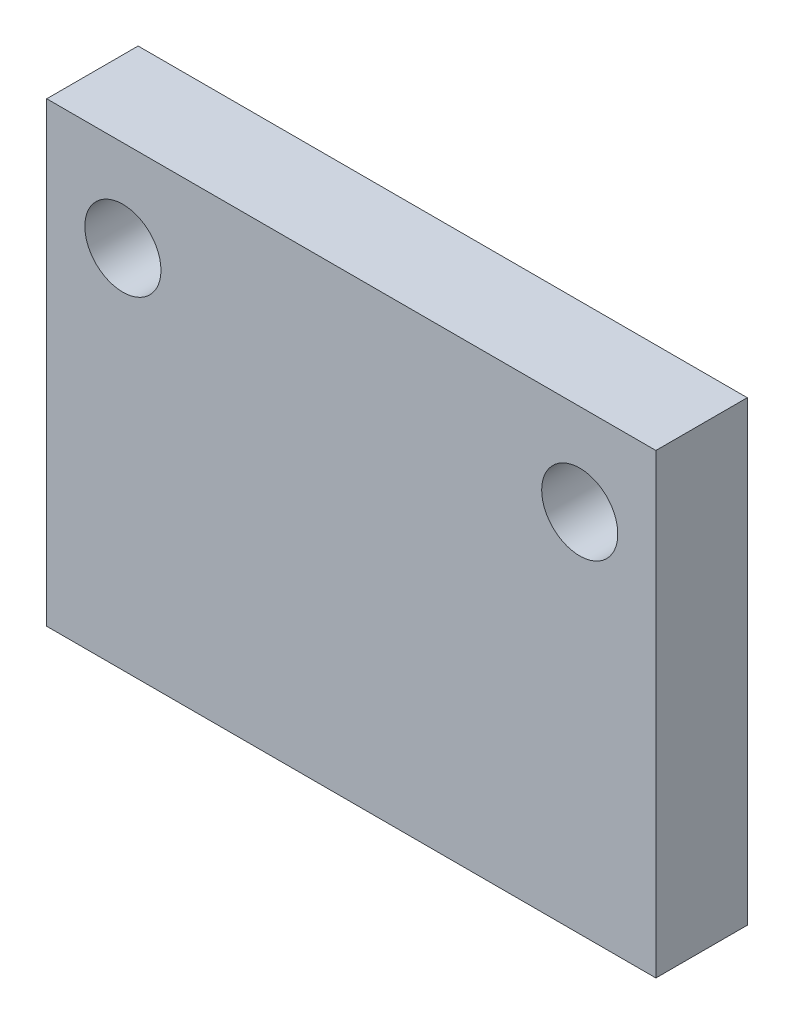
ISO-10303-21;
HEADER;
FILE_DESCRIPTION(('STEP AP214'),'2;1');
FILE_NAME('part.step','',(''),(''),'','','');
FILE_SCHEMA(('AUTOMOTIVE_DESIGN { 1 0 10303 214 1 1 1 1 }'));
ENDSEC;
DATA;
#1=APPLICATION_CONTEXT('core data for automotive mechanical design processes');
#2=APPLICATION_PROTOCOL_DEFINITION('international standard','automotive_design',2000,#1);
#3=PRODUCT_CONTEXT('',#1,'mechanical');
#4=PRODUCT('Part','Part','',(#3));
#5=PRODUCT_RELATED_PRODUCT_CATEGORY('part','',(#4));
#6=PRODUCT_DEFINITION_FORMATION('','',#4);
#7=PRODUCT_DEFINITION_CONTEXT('part definition',#1,'design');
#8=PRODUCT_DEFINITION('design','',#6,#7);
#9=PRODUCT_DEFINITION_SHAPE('','',#8);
#10=(LENGTH_UNIT() NAMED_UNIT(*) SI_UNIT(.MILLI.,.METRE.));
#11=(NAMED_UNIT(*) PLANE_ANGLE_UNIT() SI_UNIT($,.RADIAN.));
#12=(NAMED_UNIT(*) SI_UNIT($,.STERADIAN.) SOLID_ANGLE_UNIT());
#13=UNCERTAINTY_MEASURE_WITH_UNIT(LENGTH_MEASURE(1.E-05),#10,'distance_accuracy_value','');
#14=(GEOMETRIC_REPRESENTATION_CONTEXT(3) GLOBAL_UNCERTAINTY_ASSIGNED_CONTEXT((#13)) GLOBAL_UNIT_ASSIGNED_CONTEXT((#10,
#11,#12)) REPRESENTATION_CONTEXT('',''));
#15=CARTESIAN_POINT('',(0.,0.,0.));
#16=DIRECTION('',(0.,0.,1.));
#17=DIRECTION('',(1.,0.,0.));
#18=AXIS2_PLACEMENT_3D('',#15,#16,#17);
#19=CARTESIAN_POINT('',(0.,0.,3.));
#20=DIRECTION('',(0.,0.,1.));
#21=DIRECTION('',(1.,0.,0.));
#22=AXIS2_PLACEMENT_3D('',#19,#20,#21);
#23=PLANE('',#22);
#24=CARTESIAN_POINT('',(-7.5,4.5,3.));
#25=DIRECTION('',(0.,0.,1.));
#26=DIRECTION('',(1.,0.,0.));
#27=AXIS2_PLACEMENT_3D('',#24,#25,#26);
#28=CIRCLE('',#27,1.25);
#29=CARTESIAN_POINT('',(-6.25,4.5,3.));
#30=VERTEX_POINT('',#29);
#31=EDGE_CURVE('E112',#30,#30,#28,.T.);
#32=ORIENTED_EDGE('',*,*,#31,.F.);
#33=EDGE_LOOP('',(#32));
#34=FACE_BOUND('',#33,.T.);
#35=DIRECTION('',(0.,1.,0.));
#36=VECTOR('',#35,1.);
#37=CARTESIAN_POINT('',(10.,7.5,3.));
#38=LINE('',#37,#36);
#39=CARTESIAN_POINT('',(10.,-7.5,3.));
#40=VERTEX_POINT('',#39);
#41=CARTESIAN_POINT('',(10.,7.5,3.));
#42=VERTEX_POINT('',#41);
#43=EDGE_CURVE('E92',#40,#42,#38,.T.);
#44=ORIENTED_EDGE('',*,*,#43,.T.);
#45=DIRECTION('',(-1.,0.,0.));
#46=VECTOR('',#45,1.);
#47=CARTESIAN_POINT('',(-10.,7.5,3.));
#48=LINE('',#47,#46);
#49=CARTESIAN_POINT('',(-10.,7.5,3.));
#50=VERTEX_POINT('',#49);
#51=EDGE_CURVE('E87',#42,#50,#48,.T.);
#52=ORIENTED_EDGE('',*,*,#51,.T.);
#53=DIRECTION('',(0.,-1.,0.));
#54=VECTOR('',#53,1.);
#55=CARTESIAN_POINT('',(-10.,7.5,3.));
#56=LINE('',#55,#54);
#57=CARTESIAN_POINT('',(-10.,-7.5,3.));
#58=VERTEX_POINT('',#57);
#59=EDGE_CURVE('E90',#50,#58,#56,.T.);
#60=ORIENTED_EDGE('',*,*,#59,.T.);
#61=DIRECTION('',(1.,0.,0.));
#62=VECTOR('',#61,1.);
#63=CARTESIAN_POINT('',(-10.,-7.5,3.));
#64=LINE('',#63,#62);
#65=EDGE_CURVE('E57',#58,#40,#64,.T.);
#66=ORIENTED_EDGE('',*,*,#65,.T.);
#67=EDGE_LOOP('',(#44,#52,#60,#66));
#68=FACE_BOUND('',#67,.T.);
#69=CARTESIAN_POINT('',(7.5,4.5,3.));
#70=DIRECTION('',(0.,0.,1.));
#71=DIRECTION('',(-1.,0.,0.));
#72=AXIS2_PLACEMENT_3D('',#69,#70,#71);
#73=CIRCLE('',#72,1.25);
#74=CARTESIAN_POINT('',(6.25,4.5,3.));
#75=VERTEX_POINT('',#74);
#76=EDGE_CURVE('E134',#75,#75,#73,.T.);
#77=ORIENTED_EDGE('',*,*,#76,.F.);
#78=EDGE_LOOP('',(#77));
#79=FACE_BOUND('',#78,.T.);
#80=ADVANCED_FACE('F39',(#34,#68,#79),#23,.T.);
#81=CARTESIAN_POINT('',(0.,0.,0.));
#82=DIRECTION('',(0.,0.,1.));
#83=DIRECTION('',(1.,0.,0.));
#84=AXIS2_PLACEMENT_3D('',#81,#82,#83);
#85=PLANE('',#84);
#86=DIRECTION('',(0.,1.,0.));
#87=VECTOR('',#86,1.);
#88=CARTESIAN_POINT('',(10.,7.5,0.));
#89=LINE('',#88,#87);
#90=CARTESIAN_POINT('',(10.,-7.5,0.));
#91=VERTEX_POINT('',#90);
#92=CARTESIAN_POINT('',(10.,7.5,0.));
#93=VERTEX_POINT('',#92);
#94=EDGE_CURVE('E108',#91,#93,#89,.T.);
#95=ORIENTED_EDGE('',*,*,#94,.F.);
#96=DIRECTION('',(1.,0.,0.));
#97=VECTOR('',#96,1.);
#98=CARTESIAN_POINT('',(-10.,-7.5,0.));
#99=LINE('',#98,#97);
#100=CARTESIAN_POINT('',(-10.,-7.5,0.));
#101=VERTEX_POINT('',#100);
#102=EDGE_CURVE('E80',#101,#91,#99,.T.);
#103=ORIENTED_EDGE('',*,*,#102,.F.);
#104=DIRECTION('',(0.,-1.,0.));
#105=VECTOR('',#104,1.);
#106=CARTESIAN_POINT('',(-10.,7.5,0.));
#107=LINE('',#106,#105);
#108=CARTESIAN_POINT('',(-10.,7.5,0.));
#109=VERTEX_POINT('',#108);
#110=EDGE_CURVE('E74',#109,#101,#107,.T.);
#111=ORIENTED_EDGE('',*,*,#110,.F.);
#112=DIRECTION('',(-1.,0.,0.));
#113=VECTOR('',#112,1.);
#114=CARTESIAN_POINT('',(-10.,7.5,0.));
#115=LINE('',#114,#113);
#116=EDGE_CURVE('E97',#93,#109,#115,.T.);
#117=ORIENTED_EDGE('',*,*,#116,.F.);
#118=EDGE_LOOP('',(#95,#103,#111,#117));
#119=FACE_BOUND('',#118,.T.);
#120=CARTESIAN_POINT('',(-7.5,4.5,0.));
#121=DIRECTION('',(0.,0.,1.));
#122=DIRECTION('',(1.,0.,0.));
#123=AXIS2_PLACEMENT_3D('',#120,#121,#122);
#124=CIRCLE('',#123,1.25);
#125=CARTESIAN_POINT('',(-6.25,4.5,0.));
#126=VERTEX_POINT('',#125);
#127=EDGE_CURVE('E130',#126,#126,#124,.T.);
#128=ORIENTED_EDGE('',*,*,#127,.T.);
#129=EDGE_LOOP('',(#128));
#130=FACE_BOUND('',#129,.T.);
#131=CARTESIAN_POINT('',(7.5,4.5,0.));
#132=DIRECTION('',(0.,0.,1.));
#133=DIRECTION('',(-1.,0.,0.));
#134=AXIS2_PLACEMENT_3D('',#131,#132,#133);
#135=CIRCLE('',#134,1.25);
#136=CARTESIAN_POINT('',(6.25,4.5,0.));
#137=VERTEX_POINT('',#136);
#138=EDGE_CURVE('E138',#137,#137,#135,.T.);
#139=ORIENTED_EDGE('',*,*,#138,.T.);
#140=EDGE_LOOP('',(#139));
#141=FACE_BOUND('',#140,.T.);
#142=ADVANCED_FACE('F125',(#119,#130,#141),#85,.F.);
#143=CARTESIAN_POINT('',(10.,7.5,3.));
#144=DIRECTION('',(-1.,0.,0.));
#145=DIRECTION('',(0.,0.,1.));
#146=AXIS2_PLACEMENT_3D('',#143,#144,#145);
#147=PLANE('',#146);
#148=ORIENTED_EDGE('',*,*,#94,.T.);
#149=DIRECTION('',(0.,0.,-1.));
#150=VECTOR('',#149,1.);
#151=CARTESIAN_POINT('',(10.,7.5,3.));
#152=LINE('',#151,#150);
#153=EDGE_CURVE('E11',#42,#93,#152,.T.);
#154=ORIENTED_EDGE('',*,*,#153,.F.);
#155=ORIENTED_EDGE('',*,*,#43,.F.);
#156=DIRECTION('',(0.,0.,-1.));
#157=VECTOR('',#156,1.);
#158=CARTESIAN_POINT('',(10.,-7.5,3.));
#159=LINE('',#158,#157);
#160=EDGE_CURVE('E104',#40,#91,#159,.T.);
#161=ORIENTED_EDGE('',*,*,#160,.T.);
#162=EDGE_LOOP('',(#148,#154,#155,#161));
#163=FACE_BOUND('',#162,.T.);
#164=ADVANCED_FACE('F41',(#163),#147,.F.);
#165=CARTESIAN_POINT('',(-10.,7.5,3.));
#166=DIRECTION('',(0.,-1.,0.));
#167=DIRECTION('',(0.,0.,-1.));
#168=AXIS2_PLACEMENT_3D('',#165,#166,#167);
#169=PLANE('',#168);
#170=ORIENTED_EDGE('',*,*,#116,.T.);
#171=DIRECTION('',(0.,0.,-1.));
#172=VECTOR('',#171,1.);
#173=CARTESIAN_POINT('',(-10.,7.5,3.));
#174=LINE('',#173,#172);
#175=EDGE_CURVE('E49',#50,#109,#174,.T.);
#176=ORIENTED_EDGE('',*,*,#175,.F.);
#177=ORIENTED_EDGE('',*,*,#51,.F.);
#178=ORIENTED_EDGE('',*,*,#153,.T.);
#179=EDGE_LOOP('',(#170,#176,#177,#178));
#180=FACE_BOUND('',#179,.T.);
#181=ADVANCED_FACE('F96',(#180),#169,.F.);
#182=CARTESIAN_POINT('',(-10.,7.5,3.));
#183=DIRECTION('',(1.,0.,0.));
#184=DIRECTION('',(0.,0.,-1.));
#185=AXIS2_PLACEMENT_3D('',#182,#183,#184);
#186=PLANE('',#185);
#187=ORIENTED_EDGE('',*,*,#110,.T.);
#188=DIRECTION('',(0.,0.,-1.));
#189=VECTOR('',#188,1.);
#190=CARTESIAN_POINT('',(-10.,-7.5,3.));
#191=LINE('',#190,#189);
#192=EDGE_CURVE('E99',#58,#101,#191,.T.);
#193=ORIENTED_EDGE('',*,*,#192,.F.);
#194=ORIENTED_EDGE('',*,*,#59,.F.);
#195=ORIENTED_EDGE('',*,*,#175,.T.);
#196=EDGE_LOOP('',(#187,#193,#194,#195));
#197=FACE_BOUND('',#196,.T.);
#198=ADVANCED_FACE('F100',(#197),#186,.F.);
#199=CARTESIAN_POINT('',(-10.,-7.5,3.));
#200=DIRECTION('',(0.,1.,0.));
#201=DIRECTION('',(0.,0.,1.));
#202=AXIS2_PLACEMENT_3D('',#199,#200,#201);
#203=PLANE('',#202);
#204=ORIENTED_EDGE('',*,*,#102,.T.);
#205=ORIENTED_EDGE('',*,*,#160,.F.);
#206=ORIENTED_EDGE('',*,*,#65,.F.);
#207=ORIENTED_EDGE('',*,*,#192,.T.);
#208=EDGE_LOOP('',(#204,#205,#206,#207));
#209=FACE_BOUND('',#208,.T.);
#210=ADVANCED_FACE('F122',(#209),#203,.F.);
#211=CARTESIAN_POINT('',(-7.5,4.5,3.));
#212=DIRECTION('',(0.,0.,-1.));
#213=DIRECTION('',(-1.,0.,0.));
#214=AXIS2_PLACEMENT_3D('',#211,#212,#213);
#215=CYLINDRICAL_SURFACE('',#214,1.25);
#216=ORIENTED_EDGE('',*,*,#31,.T.);
#217=EDGE_LOOP('',(#216));
#218=FACE_BOUND('',#217,.T.);
#219=ORIENTED_EDGE('',*,*,#127,.F.);
#220=EDGE_LOOP('',(#219));
#221=FACE_BOUND('',#220,.T.);
#222=ADVANCED_FACE('F157',(#218,#221),#215,.F.);
#223=CARTESIAN_POINT('',(7.5,4.5,3.));
#224=DIRECTION('',(0.,0.,-1.));
#225=DIRECTION('',(-1.,0.,0.));
#226=AXIS2_PLACEMENT_3D('',#223,#224,#225);
#227=CYLINDRICAL_SURFACE('',#226,1.25);
#228=ORIENTED_EDGE('',*,*,#76,.T.);
#229=EDGE_LOOP('',(#228));
#230=FACE_BOUND('',#229,.T.);
#231=ORIENTED_EDGE('',*,*,#138,.F.);
#232=EDGE_LOOP('',(#231));
#233=FACE_BOUND('',#232,.T.);
#234=ADVANCED_FACE('F146',(#230,#233),#227,.F.);
#235=CLOSED_SHELL('',(#80,#142,#164,#181,#198,#210,#222,#234));
#236=MANIFOLD_SOLID_BREP('B2',#235);
#237=ADVANCED_BREP_SHAPE_REPRESENTATION('',(#18,#236),#14);
#238=SHAPE_DEFINITION_REPRESENTATION(#9,#237);
ENDSEC;
END-ISO-10303-21;
